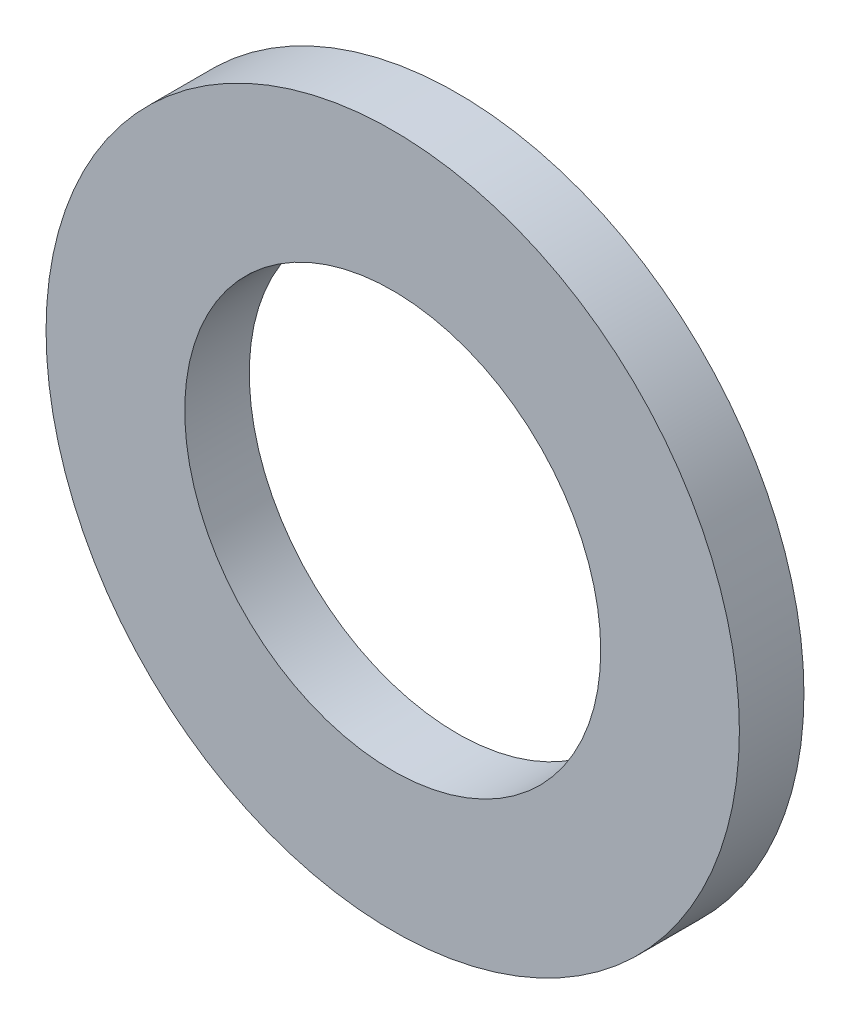
ISO-10303-21;
HEADER;
FILE_DESCRIPTION(('STEP AP214'),'2;1');
FILE_NAME('part.step','',(''),(''),'','','');
FILE_SCHEMA(('AUTOMOTIVE_DESIGN { 1 0 10303 214 1 1 1 1 }'));
ENDSEC;
DATA;
#1=APPLICATION_CONTEXT('core data for automotive mechanical design processes');
#2=APPLICATION_PROTOCOL_DEFINITION('international standard','automotive_design',2000,#1);
#3=PRODUCT_CONTEXT('',#1,'mechanical');
#4=PRODUCT('Part','Part','',(#3));
#5=PRODUCT_RELATED_PRODUCT_CATEGORY('part','',(#4));
#6=PRODUCT_DEFINITION_FORMATION('','',#4);
#7=PRODUCT_DEFINITION_CONTEXT('part definition',#1,'design');
#8=PRODUCT_DEFINITION('design','',#6,#7);
#9=PRODUCT_DEFINITION_SHAPE('','',#8);
#10=(LENGTH_UNIT() NAMED_UNIT(*) SI_UNIT(.MILLI.,.METRE.));
#11=(NAMED_UNIT(*) PLANE_ANGLE_UNIT() SI_UNIT($,.RADIAN.));
#12=(NAMED_UNIT(*) SI_UNIT($,.STERADIAN.) SOLID_ANGLE_UNIT());
#13=UNCERTAINTY_MEASURE_WITH_UNIT(LENGTH_MEASURE(1.E-05),#10,'distance_accuracy_value','');
#14=(GEOMETRIC_REPRESENTATION_CONTEXT(3) GLOBAL_UNCERTAINTY_ASSIGNED_CONTEXT((#13)) GLOBAL_UNIT_ASSIGNED_CONTEXT((#10,
#11,#12)) REPRESENTATION_CONTEXT('',''));
#15=CARTESIAN_POINT('',(0.,0.,0.));
#16=DIRECTION('',(0.,0.,1.));
#17=DIRECTION('',(1.,0.,0.));
#18=AXIS2_PLACEMENT_3D('',#15,#16,#17);
#19=CARTESIAN_POINT('',(0.,0.,2.36474));
#20=DIRECTION('',(0.,0.,1.));
#21=DIRECTION('',(1.,0.,0.));
#22=AXIS2_PLACEMENT_3D('',#19,#20,#21);
#23=PLANE('',#22);
#24=CARTESIAN_POINT('',(0.,0.,2.36474));
#25=DIRECTION('',(0.,0.,1.));
#26=DIRECTION('',(1.,0.,0.));
#27=AXIS2_PLACEMENT_3D('',#24,#25,#26);
#28=CIRCLE('',#27,12.7);
#29=CARTESIAN_POINT('',(12.7,0.,2.36474));
#30=VERTEX_POINT('',#29);
#31=EDGE_CURVE('E10',#30,#30,#28,.T.);
#32=ORIENTED_EDGE('',*,*,#31,.T.);
#33=EDGE_LOOP('',(#32));
#34=FACE_BOUND('',#33,.T.);
#35=CARTESIAN_POINT('',(0.,0.,2.36474));
#36=DIRECTION('',(0.,0.,1.));
#37=DIRECTION('',(1.,0.,0.));
#38=AXIS2_PLACEMENT_3D('',#35,#36,#37);
#39=CIRCLE('',#38,7.62);
#40=CARTESIAN_POINT('',(7.62,0.,2.36474));
#41=VERTEX_POINT('',#40);
#42=EDGE_CURVE('E44',#41,#41,#39,.T.);
#43=ORIENTED_EDGE('',*,*,#42,.F.);
#44=EDGE_LOOP('',(#43));
#45=FACE_BOUND('',#44,.T.);
#46=ADVANCED_FACE('F33',(#34,#45),#23,.T.);
#47=CARTESIAN_POINT('',(0.,0.,0.));
#48=DIRECTION('',(0.,0.,1.));
#49=DIRECTION('',(1.,0.,0.));
#50=AXIS2_PLACEMENT_3D('',#47,#48,#49);
#51=PLANE('',#50);
#52=CARTESIAN_POINT('',(0.,0.,0.));
#53=DIRECTION('',(0.,0.,1.));
#54=DIRECTION('',(1.,0.,0.));
#55=AXIS2_PLACEMENT_3D('',#52,#53,#54);
#56=CIRCLE('',#55,12.7);
#57=CARTESIAN_POINT('',(12.7,0.,0.));
#58=VERTEX_POINT('',#57);
#59=EDGE_CURVE('E37',#58,#58,#56,.T.);
#60=ORIENTED_EDGE('',*,*,#59,.F.);
#61=EDGE_LOOP('',(#60));
#62=FACE_BOUND('',#61,.T.);
#63=CARTESIAN_POINT('',(0.,0.,0.));
#64=DIRECTION('',(0.,0.,1.));
#65=DIRECTION('',(1.,0.,0.));
#66=AXIS2_PLACEMENT_3D('',#63,#64,#65);
#67=CIRCLE('',#66,7.62);
#68=CARTESIAN_POINT('',(7.62,0.,0.));
#69=VERTEX_POINT('',#68);
#70=EDGE_CURVE('E46',#69,#69,#67,.T.);
#71=ORIENTED_EDGE('',*,*,#70,.T.);
#72=EDGE_LOOP('',(#71));
#73=FACE_BOUND('',#72,.T.);
#74=ADVANCED_FACE('F56',(#62,#73),#51,.F.);
#75=CARTESIAN_POINT('',(0.,0.,2.36474));
#76=DIRECTION('',(0.,0.,-1.));
#77=DIRECTION('',(-1.,0.,0.));
#78=AXIS2_PLACEMENT_3D('',#75,#76,#77);
#79=CYLINDRICAL_SURFACE('',#78,12.7);
#80=ORIENTED_EDGE('',*,*,#31,.F.);
#81=EDGE_LOOP('',(#80));
#82=FACE_BOUND('',#81,.T.);
#83=ORIENTED_EDGE('',*,*,#59,.T.);
#84=EDGE_LOOP('',(#83));
#85=FACE_BOUND('',#84,.T.);
#86=ADVANCED_FACE('F35',(#82,#85),#79,.T.);
#87=CARTESIAN_POINT('',(0.,0.,2.36474));
#88=DIRECTION('',(0.,0.,-1.));
#89=DIRECTION('',(-1.,0.,0.));
#90=AXIS2_PLACEMENT_3D('',#87,#88,#89);
#91=CYLINDRICAL_SURFACE('',#90,7.62);
#92=ORIENTED_EDGE('',*,*,#42,.T.);
#93=EDGE_LOOP('',(#92));
#94=FACE_BOUND('',#93,.T.);
#95=ORIENTED_EDGE('',*,*,#70,.F.);
#96=EDGE_LOOP('',(#95));
#97=FACE_BOUND('',#96,.T.);
#98=ADVANCED_FACE('F52',(#94,#97),#91,.F.);
#99=CLOSED_SHELL('',(#46,#74,#86,#98));
#100=MANIFOLD_SOLID_BREP('B2',#99);
#101=ADVANCED_BREP_SHAPE_REPRESENTATION('',(#18,#100),#14);
#102=SHAPE_DEFINITION_REPRESENTATION(#9,#101);
ENDSEC;
END-ISO-10303-21;
